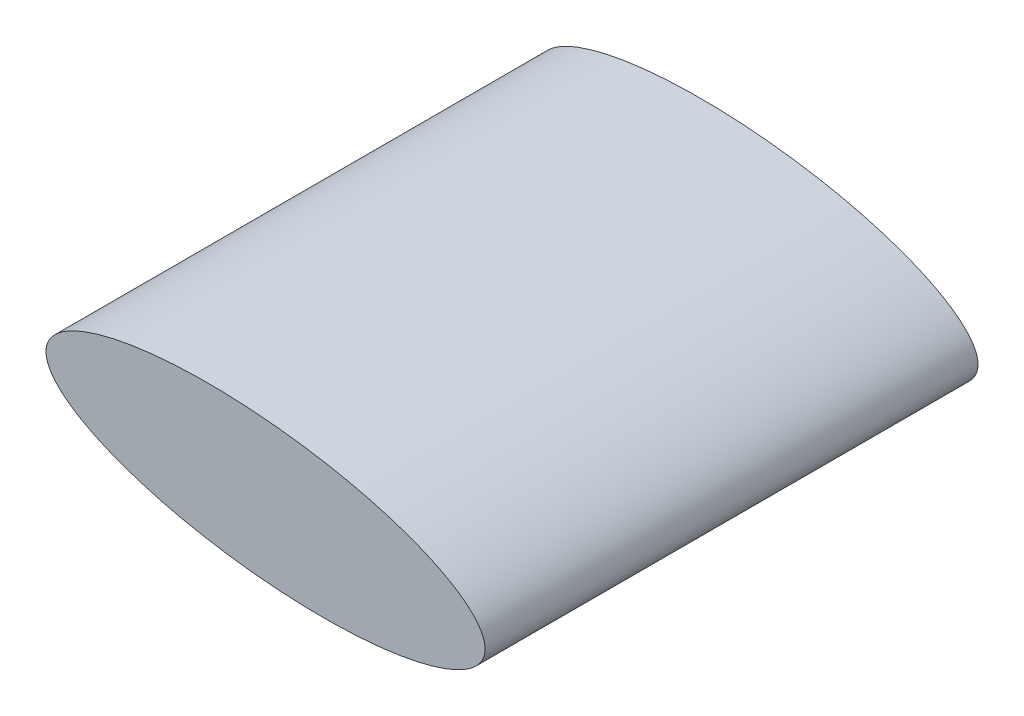
ISO-10303-21;
HEADER;
FILE_DESCRIPTION(('STEP AP214'),'2;1');
FILE_NAME('part.step','',(''),(''),'','','');
FILE_SCHEMA(('AUTOMOTIVE_DESIGN { 1 0 10303 214 1 1 1 1 }'));
ENDSEC;
DATA;
#1=APPLICATION_CONTEXT('core data for automotive mechanical design processes');
#2=APPLICATION_PROTOCOL_DEFINITION('international standard','automotive_design',2000,#1);
#3=PRODUCT_CONTEXT('',#1,'mechanical');
#4=PRODUCT('Part','Part','',(#3));
#5=PRODUCT_RELATED_PRODUCT_CATEGORY('part','',(#4));
#6=PRODUCT_DEFINITION_FORMATION('','',#4);
#7=PRODUCT_DEFINITION_CONTEXT('part definition',#1,'design');
#8=PRODUCT_DEFINITION('design','',#6,#7);
#9=PRODUCT_DEFINITION_SHAPE('','',#8);
#10=(LENGTH_UNIT() NAMED_UNIT(*) SI_UNIT(.MILLI.,.METRE.));
#11=(NAMED_UNIT(*) PLANE_ANGLE_UNIT() SI_UNIT($,.RADIAN.));
#12=(NAMED_UNIT(*) SI_UNIT($,.STERADIAN.) SOLID_ANGLE_UNIT());
#13=UNCERTAINTY_MEASURE_WITH_UNIT(LENGTH_MEASURE(1.E-05),#10,'distance_accuracy_value','');
#14=(GEOMETRIC_REPRESENTATION_CONTEXT(3) GLOBAL_UNCERTAINTY_ASSIGNED_CONTEXT((#13)) GLOBAL_UNIT_ASSIGNED_CONTEXT((#10,
#11,#12)) REPRESENTATION_CONTEXT('',''));
#15=CARTESIAN_POINT('',(0.,0.,0.));
#16=DIRECTION('',(0.,0.,1.));
#17=DIRECTION('',(1.,0.,0.));
#18=AXIS2_PLACEMENT_3D('',#15,#16,#17);
#19=CARTESIAN_POINT('',(0.,0.,-0.625));
#20=DIRECTION('',(0.,0.,-1.));
#21=DIRECTION('',(0.995354106400236,-0.0962818927534521,0.));
#22=AXIS2_PLACEMENT_3D('',#19,#20,#21);
#23=ELLIPSE('',#22,0.246,0.078);
#24=DIRECTION('',(0.,0.,-1.));
#25=VECTOR('',#24,1.);
#26=SURFACE_OF_LINEAR_EXTRUSION('',#23,#25);
#27=CARTESIAN_POINT('',(0.244857110174458,-0.0236853456173492,-0.625));
#28=VERTEX_POINT('',#27);
#29=EDGE_CURVE('E10',#28,#28,#23,.T.);
#30=ORIENTED_EDGE('',*,*,#29,.T.);
#31=EDGE_LOOP('',(#30));
#32=FACE_BOUND('',#31,.T.);
#33=CARTESIAN_POINT('',(0.,0.,-1.175));
#34=DIRECTION('',(0.,0.,-1.));
#35=DIRECTION('',(0.995354106400236,-0.0962818927534521,0.));
#36=AXIS2_PLACEMENT_3D('',#33,#34,#35);
#37=ELLIPSE('',#36,0.246,0.078);
#38=CARTESIAN_POINT('',(0.244857110174458,-0.0236853456173492,-1.175));
#39=VERTEX_POINT('',#38);
#40=EDGE_CURVE('E37',#39,#39,#37,.T.);
#41=ORIENTED_EDGE('',*,*,#40,.F.);
#42=EDGE_LOOP('',(#41));
#43=FACE_BOUND('',#42,.T.);
#44=ADVANCED_FACE('F33',(#32,#43),#26,.T.);
#45=CARTESIAN_POINT('',(0.,0.,-0.625));
#46=DIRECTION('',(0.,0.,-1.));
#47=DIRECTION('',(-1.,0.,0.));
#48=AXIS2_PLACEMENT_3D('',#45,#46,#47);
#49=PLANE('',#48);
#50=ORIENTED_EDGE('',*,*,#29,.F.);
#51=EDGE_LOOP('',(#50));
#52=FACE_BOUND('',#51,.T.);
#53=ADVANCED_FACE('F49',(#52),#49,.F.);
#54=CARTESIAN_POINT('',(0.,0.,-1.175));
#55=DIRECTION('',(0.,0.,-1.));
#56=DIRECTION('',(-1.,0.,0.));
#57=AXIS2_PLACEMENT_3D('',#54,#55,#56);
#58=PLANE('',#57);
#59=ORIENTED_EDGE('',*,*,#40,.T.);
#60=EDGE_LOOP('',(#59));
#61=FACE_BOUND('',#60,.T.);
#62=ADVANCED_FACE('F46',(#61),#58,.T.);
#63=CLOSED_SHELL('',(#44,#53,#62));
#64=MANIFOLD_SOLID_BREP('B2',#63);
#65=ADVANCED_BREP_SHAPE_REPRESENTATION('',(#18,#64),#14);
#66=SHAPE_DEFINITION_REPRESENTATION(#9,#65);
ENDSEC;
END-ISO-10303-21;
